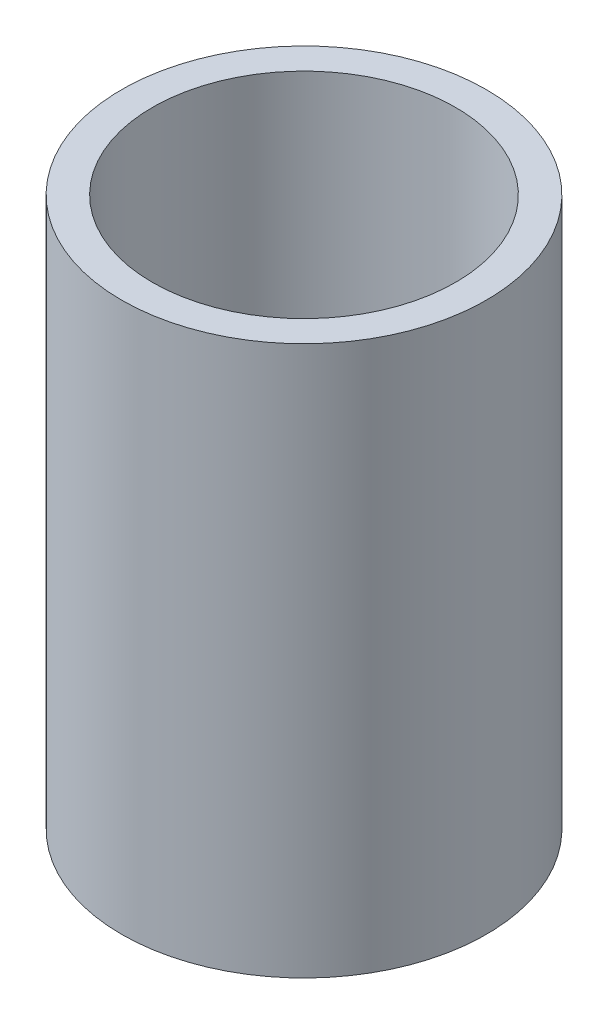
ISO-10303-21;
HEADER;
FILE_DESCRIPTION(('STEP AP214'),'2;1');
FILE_NAME('part.step','',(''),(''),'','','');
FILE_SCHEMA(('AUTOMOTIVE_DESIGN { 1 0 10303 214 1 1 1 1 }'));
ENDSEC;
DATA;
#1=APPLICATION_CONTEXT('core data for automotive mechanical design processes');
#2=APPLICATION_PROTOCOL_DEFINITION('international standard','automotive_design',2000,#1);
#3=PRODUCT_CONTEXT('',#1,'mechanical');
#4=PRODUCT('Part','Part','',(#3));
#5=PRODUCT_RELATED_PRODUCT_CATEGORY('part','',(#4));
#6=PRODUCT_DEFINITION_FORMATION('','',#4);
#7=PRODUCT_DEFINITION_CONTEXT('part definition',#1,'design');
#8=PRODUCT_DEFINITION('design','',#6,#7);
#9=PRODUCT_DEFINITION_SHAPE('','',#8);
#10=(LENGTH_UNIT() NAMED_UNIT(*) SI_UNIT(.MILLI.,.METRE.));
#11=(NAMED_UNIT(*) PLANE_ANGLE_UNIT() SI_UNIT($,.RADIAN.));
#12=(NAMED_UNIT(*) SI_UNIT($,.STERADIAN.) SOLID_ANGLE_UNIT());
#13=UNCERTAINTY_MEASURE_WITH_UNIT(LENGTH_MEASURE(1.E-05),#10,'distance_accuracy_value','');
#14=(GEOMETRIC_REPRESENTATION_CONTEXT(3) GLOBAL_UNCERTAINTY_ASSIGNED_CONTEXT((#13)) GLOBAL_UNIT_ASSIGNED_CONTEXT((#10,
#11,#12)) REPRESENTATION_CONTEXT('',''));
#15=CARTESIAN_POINT('',(0.,0.,0.));
#16=DIRECTION('',(0.,0.,1.));
#17=DIRECTION('',(1.,0.,0.));
#18=AXIS2_PLACEMENT_3D('',#15,#16,#17);
#19=CARTESIAN_POINT('',(0.,0.,0.));
#20=DIRECTION('',(0.,1.,0.));
#21=DIRECTION('',(0.,0.,1.));
#22=AXIS2_PLACEMENT_3D('',#19,#20,#21);
#23=CYLINDRICAL_SURFACE('',#22,17.526);
#24=CARTESIAN_POINT('',(0.,0.,0.));
#25=DIRECTION('',(0.,1.,0.));
#26=DIRECTION('',(0.,0.,1.));
#27=AXIS2_PLACEMENT_3D('',#24,#25,#26);
#28=CIRCLE('',#27,17.526);
#29=CARTESIAN_POINT('',(0.,0.,17.526));
#30=VERTEX_POINT('',#29);
#31=EDGE_CURVE('E27',#30,#30,#28,.F.);
#32=ORIENTED_EDGE('',*,*,#31,.T.);
#33=EDGE_LOOP('',(#32));
#34=FACE_BOUND('',#33,.T.);
#35=CARTESIAN_POINT('',(0.,63.5,0.));
#36=DIRECTION('',(0.,1.,0.));
#37=DIRECTION('',(0.,0.,1.));
#38=AXIS2_PLACEMENT_3D('',#35,#36,#37);
#39=CIRCLE('',#38,17.526);
#40=CARTESIAN_POINT('',(0.,63.5,17.526));
#41=VERTEX_POINT('',#40);
#42=EDGE_CURVE('E18',#41,#41,#39,.F.);
#43=ORIENTED_EDGE('',*,*,#42,.F.);
#44=EDGE_LOOP('',(#43));
#45=FACE_BOUND('',#44,.T.);
#46=ADVANCED_FACE('F15',(#34,#45),#23,.F.);
#47=CARTESIAN_POINT('',(0.,63.5,0.));
#48=DIRECTION('',(0.,1.,0.));
#49=DIRECTION('',(0.,0.,1.));
#50=AXIS2_PLACEMENT_3D('',#47,#48,#49);
#51=PLANE('',#50);
#52=ORIENTED_EDGE('',*,*,#42,.T.);
#53=EDGE_LOOP('',(#52));
#54=FACE_BOUND('',#53,.T.);
#55=CARTESIAN_POINT('',(0.,63.5,0.));
#56=DIRECTION('',(0.,1.,0.));
#57=DIRECTION('',(0.,0.,1.));
#58=AXIS2_PLACEMENT_3D('',#55,#56,#57);
#59=CIRCLE('',#58,21.082);
#60=CARTESIAN_POINT('',(0.,63.5,21.082));
#61=VERTEX_POINT('',#60);
#62=EDGE_CURVE('E22',#61,#61,#59,.F.);
#63=ORIENTED_EDGE('',*,*,#62,.F.);
#64=EDGE_LOOP('',(#63));
#65=FACE_BOUND('',#64,.T.);
#66=ADVANCED_FACE('F35',(#54,#65),#51,.T.);
#67=CARTESIAN_POINT('',(0.,0.,0.));
#68=DIRECTION('',(0.,1.,0.));
#69=DIRECTION('',(0.,0.,1.));
#70=AXIS2_PLACEMENT_3D('',#67,#68,#69);
#71=PLANE('',#70);
#72=ORIENTED_EDGE('',*,*,#31,.F.);
#73=EDGE_LOOP('',(#72));
#74=FACE_BOUND('',#73,.T.);
#75=CARTESIAN_POINT('',(0.,0.,0.));
#76=DIRECTION('',(0.,1.,0.));
#77=DIRECTION('',(0.,0.,1.));
#78=AXIS2_PLACEMENT_3D('',#75,#76,#77);
#79=CIRCLE('',#78,21.082);
#80=CARTESIAN_POINT('',(0.,0.,21.082));
#81=VERTEX_POINT('',#80);
#82=EDGE_CURVE('E10',#81,#81,#79,.T.);
#83=ORIENTED_EDGE('',*,*,#82,.F.);
#84=EDGE_LOOP('',(#83));
#85=FACE_BOUND('',#84,.T.);
#86=ADVANCED_FACE('F43',(#74,#85),#71,.F.);
#87=CARTESIAN_POINT('',(0.,0.,0.));
#88=DIRECTION('',(0.,1.,0.));
#89=DIRECTION('',(0.,0.,1.));
#90=AXIS2_PLACEMENT_3D('',#87,#88,#89);
#91=CYLINDRICAL_SURFACE('',#90,21.082);
#92=ORIENTED_EDGE('',*,*,#82,.T.);
#93=EDGE_LOOP('',(#92));
#94=FACE_BOUND('',#93,.T.);
#95=ORIENTED_EDGE('',*,*,#62,.T.);
#96=EDGE_LOOP('',(#95));
#97=FACE_BOUND('',#96,.T.);
#98=ADVANCED_FACE('F44',(#94,#97),#91,.T.);
#99=CLOSED_SHELL('',(#46,#66,#86,#98));
#100=MANIFOLD_SOLID_BREP('B1',#99);
#101=ADVANCED_BREP_SHAPE_REPRESENTATION('',(#18,#100),#14);
#102=SHAPE_DEFINITION_REPRESENTATION(#9,#101);
ENDSEC;
END-ISO-10303-21;
